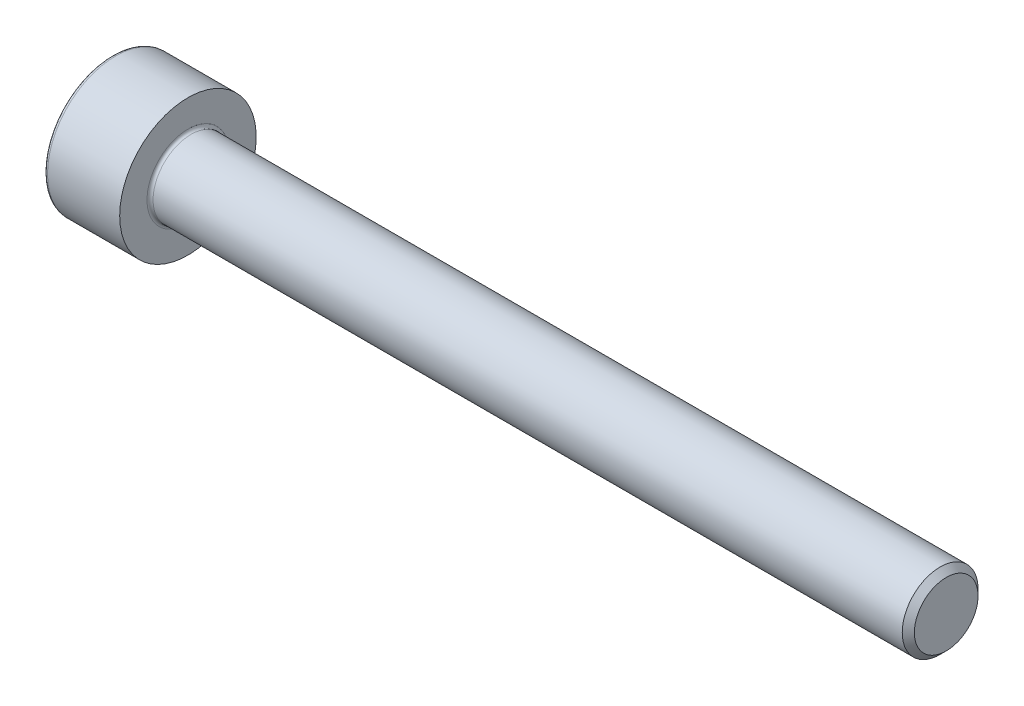
ISO-10303-21;
HEADER;
FILE_DESCRIPTION(('STEP AP214'),'2;1');
FILE_NAME('part.step','',(''),(''),'','','');
FILE_SCHEMA(('AUTOMOTIVE_DESIGN { 1 0 10303 214 1 1 1 1 }'));
ENDSEC;
DATA;
#1=APPLICATION_CONTEXT('core data for automotive mechanical design processes');
#2=APPLICATION_PROTOCOL_DEFINITION('international standard','automotive_design',2000,#1);
#3=PRODUCT_CONTEXT('',#1,'mechanical');
#4=PRODUCT('Part','Part','',(#3));
#5=PRODUCT_RELATED_PRODUCT_CATEGORY('part','',(#4));
#6=PRODUCT_DEFINITION_FORMATION('','',#4);
#7=PRODUCT_DEFINITION_CONTEXT('part definition',#1,'design');
#8=PRODUCT_DEFINITION('design','',#6,#7);
#9=PRODUCT_DEFINITION_SHAPE('','',#8);
#10=(LENGTH_UNIT() NAMED_UNIT(*) SI_UNIT(.MILLI.,.METRE.));
#11=(NAMED_UNIT(*) PLANE_ANGLE_UNIT() SI_UNIT($,.RADIAN.));
#12=(NAMED_UNIT(*) SI_UNIT($,.STERADIAN.) SOLID_ANGLE_UNIT());
#13=UNCERTAINTY_MEASURE_WITH_UNIT(LENGTH_MEASURE(1.E-05),#10,'distance_accuracy_value','');
#14=(GEOMETRIC_REPRESENTATION_CONTEXT(3) GLOBAL_UNCERTAINTY_ASSIGNED_CONTEXT((#13)) GLOBAL_UNIT_ASSIGNED_CONTEXT((#10,
#11,#12)) REPRESENTATION_CONTEXT('',''));
#15=CARTESIAN_POINT('',(0.,0.,0.));
#16=DIRECTION('',(0.,0.,1.));
#17=DIRECTION('',(1.,0.,0.));
#18=AXIS2_PLACEMENT_3D('',#15,#16,#17);
#19=CARTESIAN_POINT('',(27.5,0.,0.));
#20=DIRECTION('',(-1.,0.,0.));
#21=DIRECTION('',(0.,0.,1.));
#22=AXIS2_PLACEMENT_3D('',#19,#20,#21);
#23=PLANE('',#22);
#24=CARTESIAN_POINT('',(27.5,0.,0.));
#25=DIRECTION('',(-1.,0.,0.));
#26=DIRECTION('',(0.,0.,1.));
#27=AXIS2_PLACEMENT_3D('',#24,#25,#26);
#28=CIRCLE('',#27,1.05);
#29=CARTESIAN_POINT('',(27.5,0.,1.05));
#30=VERTEX_POINT('',#29);
#31=EDGE_CURVE('E11',#30,#30,#28,.F.);
#32=ORIENTED_EDGE('',*,*,#31,.T.);
#33=EDGE_LOOP('',(#32));
#34=FACE_BOUND('',#33,.T.);
#35=ADVANCED_FACE('F35',(#34),#23,.F.);
#36=CARTESIAN_POINT('',(0.,0.,0.));
#37=DIRECTION('',(-1.,0.,0.));
#38=DIRECTION('',(0.,0.,1.));
#39=AXIS2_PLACEMENT_3D('',#36,#37,#38);
#40=CYLINDRICAL_SURFACE('',#39,1.25);
#41=CARTESIAN_POINT('',(27.3,0.,0.));
#42=DIRECTION('',(-1.,0.,0.));
#43=DIRECTION('',(0.,0.,1.));
#44=AXIS2_PLACEMENT_3D('',#41,#42,#43);
#45=CIRCLE('',#44,1.25);
#46=CARTESIAN_POINT('',(27.3,0.,1.25));
#47=VERTEX_POINT('',#46);
#48=EDGE_CURVE('E43',#47,#47,#45,.T.);
#49=ORIENTED_EDGE('',*,*,#48,.T.);
#50=EDGE_LOOP('',(#49));
#51=FACE_BOUND('',#50,.T.);
#52=CARTESIAN_POINT('',(2.6,0.,0.));
#53=DIRECTION('',(1.,0.,0.));
#54=DIRECTION('',(0.,0.,-1.));
#55=AXIS2_PLACEMENT_3D('',#52,#53,#54);
#56=CIRCLE('',#55,1.25);
#57=CARTESIAN_POINT('',(2.6,0.,-1.25));
#58=VERTEX_POINT('',#57);
#59=EDGE_CURVE('E148',#58,#58,#56,.T.);
#60=ORIENTED_EDGE('',*,*,#59,.T.);
#61=EDGE_LOOP('',(#60));
#62=FACE_BOUND('',#61,.T.);
#63=ADVANCED_FACE('F159',(#51,#62),#40,.T.);
#64=CARTESIAN_POINT('',(2.5,0.,0.));
#65=DIRECTION('',(1.,0.,0.));
#66=DIRECTION('',(0.,0.,-1.));
#67=AXIS2_PLACEMENT_3D('',#64,#65,#66);
#68=PLANE('',#67);
#69=CARTESIAN_POINT('',(2.5,0.,0.));
#70=DIRECTION('',(1.,0.,0.));
#71=DIRECTION('',(0.,0.,-1.));
#72=AXIS2_PLACEMENT_3D('',#69,#70,#71);
#73=CIRCLE('',#72,1.35);
#74=CARTESIAN_POINT('',(2.5,0.,-1.35));
#75=VERTEX_POINT('',#74);
#76=EDGE_CURVE('E145',#75,#75,#73,.F.);
#77=ORIENTED_EDGE('',*,*,#76,.T.);
#78=EDGE_LOOP('',(#77));
#79=FACE_BOUND('',#78,.T.);
#80=CARTESIAN_POINT('',(2.5,0.,0.));
#81=DIRECTION('',(-1.,0.,0.));
#82=DIRECTION('',(0.,0.,1.));
#83=AXIS2_PLACEMENT_3D('',#80,#81,#82);
#84=CIRCLE('',#83,2.25);
#85=CARTESIAN_POINT('',(2.5,0.,2.25));
#86=VERTEX_POINT('',#85);
#87=EDGE_CURVE('E137',#86,#86,#84,.T.);
#88=ORIENTED_EDGE('',*,*,#87,.F.);
#89=EDGE_LOOP('',(#88));
#90=FACE_BOUND('',#89,.T.);
#91=ADVANCED_FACE('F181',(#79,#90),#68,.T.);
#92=CARTESIAN_POINT('',(0.,0.,0.));
#93=DIRECTION('',(-1.,0.,0.));
#94=DIRECTION('',(0.,0.,1.));
#95=AXIS2_PLACEMENT_3D('',#92,#93,#94);
#96=CYLINDRICAL_SURFACE('',#95,2.25);
#97=CARTESIAN_POINT('',(0.12,0.,0.));
#98=DIRECTION('',(-1.,0.,0.));
#99=DIRECTION('',(0.,0.,1.));
#100=AXIS2_PLACEMENT_3D('',#97,#98,#99);
#101=CIRCLE('',#100,2.25);
#102=CARTESIAN_POINT('',(0.12,0.,2.25));
#103=VERTEX_POINT('',#102);
#104=EDGE_CURVE('E154',#103,#103,#101,.F.);
#105=ORIENTED_EDGE('',*,*,#104,.T.);
#106=EDGE_LOOP('',(#105));
#107=FACE_BOUND('',#106,.T.);
#108=ORIENTED_EDGE('',*,*,#87,.T.);
#109=EDGE_LOOP('',(#108));
#110=FACE_BOUND('',#109,.T.);
#111=ADVANCED_FACE('F191',(#107,#110),#96,.T.);
#112=CARTESIAN_POINT('',(0.,0.,0.));
#113=DIRECTION('',(-1.,0.,0.));
#114=DIRECTION('',(0.,0.,1.));
#115=AXIS2_PLACEMENT_3D('',#112,#113,#114);
#116=PLANE('',#115);
#117=DIRECTION('',(0.,0.5,-0.866025403784439));
#118=VECTOR('',#117,1.);
#119=CARTESIAN_POINT('',(0.,0.577350269189626,0.999999999999999));
#120=LINE('',#119,#118);
#121=CARTESIAN_POINT('',(0.,0.577350269189626,0.999999999999999));
#122=VERTEX_POINT('',#121);
#123=CARTESIAN_POINT('',(0.,1.15470053837925,0.));
#124=VERTEX_POINT('',#123);
#125=EDGE_CURVE('E50',#122,#124,#120,.T.);
#126=ORIENTED_EDGE('',*,*,#125,.F.);
#127=DIRECTION('',(0.,1.,0.));
#128=VECTOR('',#127,1.);
#129=CARTESIAN_POINT('',(0.,-0.577350269189626,1.));
#130=LINE('',#129,#128);
#131=CARTESIAN_POINT('',(0.,-0.577350269189626,1.));
#132=VERTEX_POINT('',#131);
#133=EDGE_CURVE('E133',#132,#122,#130,.T.);
#134=ORIENTED_EDGE('',*,*,#133,.F.);
#135=DIRECTION('',(0.,0.5,0.866025403784439));
#136=VECTOR('',#135,1.);
#137=CARTESIAN_POINT('',(0.,-1.15470053837925,0.));
#138=LINE('',#137,#136);
#139=CARTESIAN_POINT('',(0.,-1.15470053837925,0.));
#140=VERTEX_POINT('',#139);
#141=EDGE_CURVE('E131',#140,#132,#138,.T.);
#142=ORIENTED_EDGE('',*,*,#141,.F.);
#143=DIRECTION('',(0.,-0.5,0.866025403784439));
#144=VECTOR('',#143,1.);
#145=CARTESIAN_POINT('',(0.,-0.577350269189626,-1.));
#146=LINE('',#145,#144);
#147=CARTESIAN_POINT('',(0.,-0.577350269189626,-1.));
#148=VERTEX_POINT('',#147);
#149=EDGE_CURVE('E98',#148,#140,#146,.T.);
#150=ORIENTED_EDGE('',*,*,#149,.F.);
#151=DIRECTION('',(0.,-1.,0.));
#152=VECTOR('',#151,1.);
#153=CARTESIAN_POINT('',(0.,0.577350269189626,-1.));
#154=LINE('',#153,#152);
#155=CARTESIAN_POINT('',(0.,0.577350269189626,-1.));
#156=VERTEX_POINT('',#155);
#157=EDGE_CURVE('E127',#156,#148,#154,.T.);
#158=ORIENTED_EDGE('',*,*,#157,.F.);
#159=DIRECTION('',(0.,-0.5,-0.866025403784438));
#160=VECTOR('',#159,1.);
#161=CARTESIAN_POINT('',(0.,1.15470053837925,0.));
#162=LINE('',#161,#160);
#163=EDGE_CURVE('E124',#124,#156,#162,.T.);
#164=ORIENTED_EDGE('',*,*,#163,.F.);
#165=EDGE_LOOP('',(#126,#134,#142,#150,#158,#164));
#166=FACE_BOUND('',#165,.T.);
#167=CARTESIAN_POINT('',(0.,0.,0.));
#168=DIRECTION('',(-1.,0.,0.));
#169=DIRECTION('',(0.,0.,1.));
#170=AXIS2_PLACEMENT_3D('',#167,#168,#169);
#171=CIRCLE('',#170,2.13);
#172=CARTESIAN_POINT('',(0.,0.,2.13));
#173=VERTEX_POINT('',#172);
#174=EDGE_CURVE('E151',#173,#173,#171,.T.);
#175=ORIENTED_EDGE('',*,*,#174,.T.);
#176=EDGE_LOOP('',(#175));
#177=FACE_BOUND('',#176,.T.);
#178=ADVANCED_FACE('F186',(#166,#177),#116,.T.);
#179=CARTESIAN_POINT('',(2.6,0.,0.));
#180=DIRECTION('',(1.,0.,0.));
#181=DIRECTION('',(0.,0.,-1.));
#182=AXIS2_PLACEMENT_3D('',#179,#180,#181);
#183=TOROIDAL_SURFACE('',#182,1.35,0.1);
#184=ORIENTED_EDGE('',*,*,#59,.F.);
#185=EDGE_LOOP('',(#184));
#186=FACE_BOUND('',#185,.T.);
#187=ORIENTED_EDGE('',*,*,#76,.F.);
#188=EDGE_LOOP('',(#187));
#189=FACE_BOUND('',#188,.T.);
#190=ADVANCED_FACE('F172',(#186,#189),#183,.F.);
#191=CARTESIAN_POINT('',(0.12,0.,0.));
#192=DIRECTION('',(-1.,0.,0.));
#193=DIRECTION('',(0.,0.,1.));
#194=AXIS2_PLACEMENT_3D('',#191,#192,#193);
#195=TOROIDAL_SURFACE('',#194,2.13,0.12);
#196=ORIENTED_EDGE('',*,*,#104,.F.);
#197=EDGE_LOOP('',(#196));
#198=FACE_BOUND('',#197,.T.);
#199=ORIENTED_EDGE('',*,*,#174,.F.);
#200=EDGE_LOOP('',(#199));
#201=FACE_BOUND('',#200,.T.);
#202=ADVANCED_FACE('F164',(#198,#201),#195,.T.);
#203=CARTESIAN_POINT('',(27.3,0.,0.));
#204=DIRECTION('',(-1.,0.,0.));
#205=DIRECTION('',(0.,0.,1.));
#206=AXIS2_PLACEMENT_3D('',#203,#204,#205);
#207=CONICAL_SURFACE('',#206,1.25,0.785398163397445);
#208=ORIENTED_EDGE('',*,*,#31,.F.);
#209=EDGE_LOOP('',(#208));
#210=FACE_BOUND('',#209,.T.);
#211=ORIENTED_EDGE('',*,*,#48,.F.);
#212=EDGE_LOOP('',(#211));
#213=FACE_BOUND('',#212,.T.);
#214=ADVANCED_FACE('F37',(#210,#213),#207,.T.);
#215=CARTESIAN_POINT('',(1.1,0.577350269189626,0.999999999999999));
#216=DIRECTION('',(0.,0.866025403784439,0.5));
#217=DIRECTION('',(0.,-0.5,0.866025403784439));
#218=AXIS2_PLACEMENT_3D('',#215,#216,#217);
#219=PLANE('',#218);
#220=ORIENTED_EDGE('',*,*,#125,.T.);
#221=DIRECTION('',(-1.,0.,0.));
#222=VECTOR('',#221,1.);
#223=CARTESIAN_POINT('',(1.1,1.15470053837925,0.));
#224=LINE('',#223,#222);
#225=CARTESIAN_POINT('',(1.1,1.15470053837925,0.));
#226=VERTEX_POINT('',#225);
#227=EDGE_CURVE('E80',#226,#124,#224,.T.);
#228=ORIENTED_EDGE('',*,*,#227,.F.);
#229=DIRECTION('',(0.,0.5,-0.866025403784439));
#230=VECTOR('',#229,1.);
#231=CARTESIAN_POINT('',(1.1,0.577350269189626,0.999999999999999));
#232=LINE('',#231,#230);
#233=CARTESIAN_POINT('',(1.1,0.577350269189626,0.999999999999999));
#234=VERTEX_POINT('',#233);
#235=EDGE_CURVE('E135',#234,#226,#232,.T.);
#236=ORIENTED_EDGE('',*,*,#235,.F.);
#237=DIRECTION('',(-1.,0.,0.));
#238=VECTOR('',#237,1.);
#239=CARTESIAN_POINT('',(1.1,0.577350269189626,0.999999999999999));
#240=LINE('',#239,#238);
#241=EDGE_CURVE('E58',#234,#122,#240,.T.);
#242=ORIENTED_EDGE('',*,*,#241,.T.);
#243=EDGE_LOOP('',(#220,#228,#236,#242));
#244=FACE_BOUND('',#243,.T.);
#245=ADVANCED_FACE('F163',(#244),#219,.F.);
#246=CARTESIAN_POINT('',(1.1,-0.577350269189626,1.));
#247=DIRECTION('',(0.,0.,1.));
#248=DIRECTION('',(0.,-1.,0.));
#249=AXIS2_PLACEMENT_3D('',#246,#247,#248);
#250=PLANE('',#249);
#251=ORIENTED_EDGE('',*,*,#133,.T.);
#252=ORIENTED_EDGE('',*,*,#241,.F.);
#253=DIRECTION('',(0.,1.,0.));
#254=VECTOR('',#253,1.);
#255=CARTESIAN_POINT('',(1.1,-0.577350269189626,1.));
#256=LINE('',#255,#254);
#257=CARTESIAN_POINT('',(1.1,-0.577350269189626,1.));
#258=VERTEX_POINT('',#257);
#259=EDGE_CURVE('E110',#258,#234,#256,.T.);
#260=ORIENTED_EDGE('',*,*,#259,.F.);
#261=DIRECTION('',(-1.,0.,0.));
#262=VECTOR('',#261,1.);
#263=CARTESIAN_POINT('',(1.1,-0.577350269189626,1.));
#264=LINE('',#263,#262);
#265=EDGE_CURVE('E102',#258,#132,#264,.T.);
#266=ORIENTED_EDGE('',*,*,#265,.T.);
#267=EDGE_LOOP('',(#251,#252,#260,#266));
#268=FACE_BOUND('',#267,.T.);
#269=ADVANCED_FACE('F170',(#268),#250,.F.);
#270=CARTESIAN_POINT('',(1.1,-1.15470053837925,0.));
#271=DIRECTION('',(0.,-0.866025403784439,0.5));
#272=DIRECTION('',(0.,-0.5,-0.866025403784439));
#273=AXIS2_PLACEMENT_3D('',#270,#271,#272);
#274=PLANE('',#273);
#275=ORIENTED_EDGE('',*,*,#141,.T.);
#276=ORIENTED_EDGE('',*,*,#265,.F.);
#277=DIRECTION('',(0.,0.5,0.866025403784439));
#278=VECTOR('',#277,1.);
#279=CARTESIAN_POINT('',(1.1,-1.15470053837925,0.));
#280=LINE('',#279,#278);
#281=CARTESIAN_POINT('',(1.1,-1.15470053837925,0.));
#282=VERTEX_POINT('',#281);
#283=EDGE_CURVE('E106',#282,#258,#280,.T.);
#284=ORIENTED_EDGE('',*,*,#283,.F.);
#285=DIRECTION('',(-1.,0.,0.));
#286=VECTOR('',#285,1.);
#287=CARTESIAN_POINT('',(1.1,-1.15470053837925,0.));
#288=LINE('',#287,#286);
#289=EDGE_CURVE('E91',#282,#140,#288,.T.);
#290=ORIENTED_EDGE('',*,*,#289,.T.);
#291=EDGE_LOOP('',(#275,#276,#284,#290));
#292=FACE_BOUND('',#291,.T.);
#293=ADVANCED_FACE('F107',(#292),#274,.F.);
#294=CARTESIAN_POINT('',(1.1,-0.577350269189626,-1.));
#295=DIRECTION('',(0.,-0.866025403784439,-0.5));
#296=DIRECTION('',(0.,0.5,-0.866025403784439));
#297=AXIS2_PLACEMENT_3D('',#294,#295,#296);
#298=PLANE('',#297);
#299=ORIENTED_EDGE('',*,*,#149,.T.);
#300=ORIENTED_EDGE('',*,*,#289,.F.);
#301=DIRECTION('',(0.,-0.5,0.866025403784439));
#302=VECTOR('',#301,1.);
#303=CARTESIAN_POINT('',(1.1,-0.577350269189626,-1.));
#304=LINE('',#303,#302);
#305=CARTESIAN_POINT('',(1.1,-0.577350269189626,-1.));
#306=VERTEX_POINT('',#305);
#307=EDGE_CURVE('E95',#306,#282,#304,.T.);
#308=ORIENTED_EDGE('',*,*,#307,.F.);
#309=DIRECTION('',(-1.,0.,0.));
#310=VECTOR('',#309,1.);
#311=CARTESIAN_POINT('',(1.1,-0.577350269189626,-1.));
#312=LINE('',#311,#310);
#313=EDGE_CURVE('E103',#306,#148,#312,.T.);
#314=ORIENTED_EDGE('',*,*,#313,.T.);
#315=EDGE_LOOP('',(#299,#300,#308,#314));
#316=FACE_BOUND('',#315,.T.);
#317=ADVANCED_FACE('F93',(#316),#298,.F.);
#318=CARTESIAN_POINT('',(1.1,0.577350269189626,-1.));
#319=DIRECTION('',(0.,0.,-1.));
#320=DIRECTION('',(0.,1.,0.));
#321=AXIS2_PLACEMENT_3D('',#318,#319,#320);
#322=PLANE('',#321);
#323=ORIENTED_EDGE('',*,*,#157,.T.);
#324=ORIENTED_EDGE('',*,*,#313,.F.);
#325=DIRECTION('',(0.,-1.,0.));
#326=VECTOR('',#325,1.);
#327=CARTESIAN_POINT('',(1.1,0.577350269189626,-1.));
#328=LINE('',#327,#326);
#329=CARTESIAN_POINT('',(1.1,0.577350269189626,-1.));
#330=VERTEX_POINT('',#329);
#331=EDGE_CURVE('E116',#330,#306,#328,.T.);
#332=ORIENTED_EDGE('',*,*,#331,.F.);
#333=DIRECTION('',(-1.,0.,0.));
#334=VECTOR('',#333,1.);
#335=CARTESIAN_POINT('',(1.1,0.577350269189626,-1.));
#336=LINE('',#335,#334);
#337=EDGE_CURVE('E140',#330,#156,#336,.T.);
#338=ORIENTED_EDGE('',*,*,#337,.T.);
#339=EDGE_LOOP('',(#323,#324,#332,#338));
#340=FACE_BOUND('',#339,.T.);
#341=ADVANCED_FACE('F211',(#340),#322,.F.);
#342=CARTESIAN_POINT('',(1.1,1.15470053837925,0.));
#343=DIRECTION('',(0.,0.866025403784438,-0.5));
#344=DIRECTION('',(0.,0.5,0.866025403784439));
#345=AXIS2_PLACEMENT_3D('',#342,#343,#344);
#346=PLANE('',#345);
#347=ORIENTED_EDGE('',*,*,#163,.T.);
#348=ORIENTED_EDGE('',*,*,#337,.F.);
#349=DIRECTION('',(0.,-0.5,-0.866025403784438));
#350=VECTOR('',#349,1.);
#351=CARTESIAN_POINT('',(1.1,1.15470053837925,0.));
#352=LINE('',#351,#350);
#353=EDGE_CURVE('E118',#226,#330,#352,.T.);
#354=ORIENTED_EDGE('',*,*,#353,.F.);
#355=ORIENTED_EDGE('',*,*,#227,.T.);
#356=EDGE_LOOP('',(#347,#348,#354,#355));
#357=FACE_BOUND('',#356,.T.);
#358=ADVANCED_FACE('F208',(#357),#346,.F.);
#359=CARTESIAN_POINT('',(1.1,0.,0.));
#360=DIRECTION('',(-1.,0.,0.));
#361=DIRECTION('',(0.,0.,1.));
#362=AXIS2_PLACEMENT_3D('',#359,#360,#361);
#363=PLANE('',#362);
#364=ORIENTED_EDGE('',*,*,#235,.T.);
#365=ORIENTED_EDGE('',*,*,#353,.T.);
#366=ORIENTED_EDGE('',*,*,#331,.T.);
#367=ORIENTED_EDGE('',*,*,#307,.T.);
#368=ORIENTED_EDGE('',*,*,#283,.T.);
#369=ORIENTED_EDGE('',*,*,#259,.T.);
#370=EDGE_LOOP('',(#364,#365,#366,#367,#368,#369));
#371=FACE_BOUND('',#370,.T.);
#372=ADVANCED_FACE('F113',(#371),#363,.T.);
#373=CLOSED_SHELL('',(#35,#63,#91,#111,#178,#190,#202,#214,#245,#269,#293,#317,#341,#358,#372));
#374=MANIFOLD_SOLID_BREP('B2',#373);
#375=ADVANCED_BREP_SHAPE_REPRESENTATION('',(#18,#374),#14);
#376=SHAPE_DEFINITION_REPRESENTATION(#9,#375);
ENDSEC;
END-ISO-10303-21;
